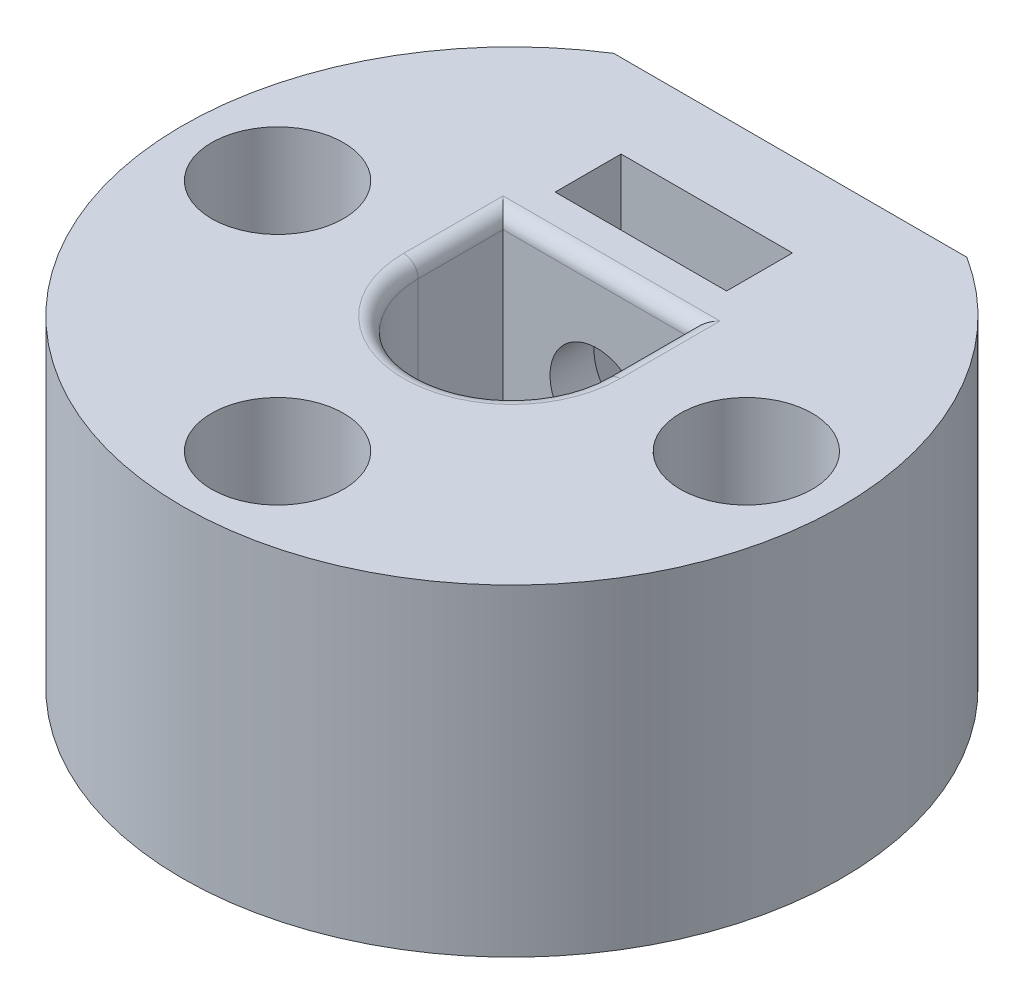
ISO-10303-21;
HEADER;
FILE_DESCRIPTION(('STEP AP214'),'2;1');
FILE_NAME('part.step','',(''),(''),'','','');
FILE_SCHEMA(('AUTOMOTIVE_DESIGN { 1 0 10303 214 1 1 1 1 }'));
ENDSEC;
DATA;
#1=APPLICATION_CONTEXT('core data for automotive mechanical design processes');
#2=APPLICATION_PROTOCOL_DEFINITION('international standard','automotive_design',2000,#1);
#3=PRODUCT_CONTEXT('',#1,'mechanical');
#4=PRODUCT('Part','Part','',(#3));
#5=PRODUCT_RELATED_PRODUCT_CATEGORY('part','',(#4));
#6=PRODUCT_DEFINITION_FORMATION('','',#4);
#7=PRODUCT_DEFINITION_CONTEXT('part definition',#1,'design');
#8=PRODUCT_DEFINITION('design','',#6,#7);
#9=PRODUCT_DEFINITION_SHAPE('','',#8);
#10=(LENGTH_UNIT() NAMED_UNIT(*) SI_UNIT(.MILLI.,.METRE.));
#11=(NAMED_UNIT(*) PLANE_ANGLE_UNIT() SI_UNIT($,.RADIAN.));
#12=(NAMED_UNIT(*) SI_UNIT($,.STERADIAN.) SOLID_ANGLE_UNIT());
#13=UNCERTAINTY_MEASURE_WITH_UNIT(LENGTH_MEASURE(1.E-05),#10,'distance_accuracy_value','');
#14=(GEOMETRIC_REPRESENTATION_CONTEXT(3) GLOBAL_UNCERTAINTY_ASSIGNED_CONTEXT((#13)) GLOBAL_UNIT_ASSIGNED_CONTEXT((#10,
#11,#12)) REPRESENTATION_CONTEXT('',''));
#15=CARTESIAN_POINT('',(0.,0.,0.));
#16=DIRECTION('',(0.,0.,1.));
#17=DIRECTION('',(1.,0.,0.));
#18=AXIS2_PLACEMENT_3D('',#15,#16,#17);
#19=CARTESIAN_POINT('',(0.,8.00000000000001,0.));
#20=DIRECTION('',(0.,1.,0.));
#21=DIRECTION('',(0.,0.,1.));
#22=AXIS2_PLACEMENT_3D('',#19,#20,#21);
#23=PLANE('',#22);
#24=CARTESIAN_POINT('',(-7.99999999999948,7.99999999999965,1.66533453693773E-13));
#25=DIRECTION('',(0.,1.,0.));
#26=DIRECTION('',(0.,0.,1.));
#27=AXIS2_PLACEMENT_3D('',#24,#25,#26);
#28=CIRCLE('',#27,2.25);
#29=CARTESIAN_POINT('',(-7.99999999999949,7.99999999999965,2.25000000000016));
#30=VERTEX_POINT('',#29);
#31=EDGE_CURVE('E484',#30,#30,#28,.T.);
#32=ORIENTED_EDGE('',*,*,#31,.F.);
#33=EDGE_LOOP('',(#32));
#34=FACE_BOUND('',#33,.T.);
#35=CARTESIAN_POINT('',(0.,8.00000000000001,7.99999999999998));
#36=DIRECTION('',(0.,1.,0.));
#37=DIRECTION('',(0.,0.,1.));
#38=AXIS2_PLACEMENT_3D('',#35,#36,#37);
#39=CIRCLE('',#38,2.25);
#40=CARTESIAN_POINT('',(0.,8.00000000000001,10.25));
#41=VERTEX_POINT('',#40);
#42=EDGE_CURVE('E501',#41,#41,#39,.T.);
#43=ORIENTED_EDGE('',*,*,#42,.F.);
#44=EDGE_LOOP('',(#43));
#45=FACE_BOUND('',#44,.T.);
#46=CARTESIAN_POINT('',(8.00000000000008,7.99999999999999,0.));
#47=DIRECTION('',(0.,1.,0.));
#48=DIRECTION('',(0.,0.,1.));
#49=AXIS2_PLACEMENT_3D('',#46,#47,#48);
#50=CIRCLE('',#49,2.25);
#51=CARTESIAN_POINT('',(8.00000000000006,7.99999999999999,2.24999999999994));
#52=VERTEX_POINT('',#51);
#53=EDGE_CURVE('E513',#52,#52,#50,.T.);
#54=ORIENTED_EDGE('',*,*,#53,.F.);
#55=EDGE_LOOP('',(#54));
#56=FACE_BOUND('',#55,.T.);
#57=DIRECTION('',(0.,0.,1.));
#58=VECTOR('',#57,1.);
#59=CARTESIAN_POINT('',(-3.69999999999952,7.99999999999965,0.));
#60=LINE('',#59,#58);
#61=CARTESIAN_POINT('',(-3.69999999999952,7.99999999999965,0.));
#62=VERTEX_POINT('',#61);
#63=CARTESIAN_POINT('',(-3.69999999999956,7.99999999999965,-3.39999999999993));
#64=VERTEX_POINT('',#63);
#65=EDGE_CURVE('E214',#62,#64,#60,.F.);
#66=ORIENTED_EDGE('',*,*,#65,.T.);
#67=DIRECTION('',(-0.999999999999986,0.,0.));
#68=VECTOR('',#67,1.);
#69=CARTESIAN_POINT('',(4.85722573273506E-13,7.99999999999965,-3.39999999999976));
#70=LINE('',#69,#68);
#71=CARTESIAN_POINT('',(3.70000000000005,8.00000000000001,-3.40000000000004));
#72=VERTEX_POINT('',#71);
#73=EDGE_CURVE('E217',#64,#72,#70,.F.);
#74=ORIENTED_EDGE('',*,*,#73,.T.);
#75=DIRECTION('',(0.,0.,-1.));
#76=VECTOR('',#75,1.);
#77=CARTESIAN_POINT('',(3.70000000000005,8.00000000000001,0.));
#78=LINE('',#77,#76);
#79=CARTESIAN_POINT('',(3.70000000000005,8.00000000000001,0.));
#80=VERTEX_POINT('',#79);
#81=EDGE_CURVE('E212',#72,#80,#78,.F.);
#82=ORIENTED_EDGE('',*,*,#81,.T.);
#83=CARTESIAN_POINT('',(0.,8.00000000000001,0.));
#84=DIRECTION('',(0.,1.,0.));
#85=DIRECTION('',(0.,0.,1.));
#86=AXIS2_PLACEMENT_3D('',#83,#84,#85);
#87=CIRCLE('',#86,3.7);
#88=EDGE_CURVE('E210',#80,#62,#87,.F.);
#89=ORIENTED_EDGE('',*,*,#88,.T.);
#90=EDGE_LOOP('',(#66,#74,#82,#89));
#91=FACE_BOUND('',#90,.T.);
#92=CARTESIAN_POINT('',(0.,8.00000000000001,0.));
#93=DIRECTION('',(0.,1.,0.));
#94=DIRECTION('',(0.,0.,1.));
#95=AXIS2_PLACEMENT_3D('',#92,#93,#94);
#96=CIRCLE('',#95,11.25);
#97=CARTESIAN_POINT('',(-6.02598539659659,7.99999999999965,-9.49999999999973));
#98=VERTEX_POINT('',#97);
#99=CARTESIAN_POINT('',(6.02598539659709,7.99999999999999,-9.49999999999993));
#100=VERTEX_POINT('',#99);
#101=EDGE_CURVE('E131',#98,#100,#96,.T.);
#102=ORIENTED_EDGE('',*,*,#101,.T.);
#103=DIRECTION('',(-0.999999999999986,0.,0.));
#104=VECTOR('',#103,1.);
#105=CARTESIAN_POINT('',(6.02598539659709,7.99999999999999,-9.49999999999993));
#106=LINE('',#105,#104);
#107=EDGE_CURVE('E134',#100,#98,#106,.T.);
#108=ORIENTED_EDGE('',*,*,#107,.T.);
#109=EDGE_LOOP('',(#102,#108));
#110=FACE_BOUND('',#109,.T.);
#111=DIRECTION('',(-0.999999999999986,0.,0.));
#112=VECTOR('',#111,1.);
#113=CARTESIAN_POINT('',(-2.92499999999946,7.99999999999965,-6.64999999999982));
#114=LINE('',#113,#112);
#115=CARTESIAN_POINT('',(2.92500000000015,7.99999999999966,-6.64999999999996));
#116=VERTEX_POINT('',#115);
#117=CARTESIAN_POINT('',(-2.92499999999946,7.99999999999965,-6.64999999999982));
#118=VERTEX_POINT('',#117);
#119=EDGE_CURVE('E152',#116,#118,#114,.T.);
#120=ORIENTED_EDGE('',*,*,#119,.F.);
#121=DIRECTION('',(0.,0.,-1.));
#122=VECTOR('',#121,1.);
#123=CARTESIAN_POINT('',(2.92500000000001,8.00000000000001,-4.40000000000001));
#124=LINE('',#123,#122);
#125=CARTESIAN_POINT('',(2.92500000000001,8.00000000000001,-4.40000000000001));
#126=VERTEX_POINT('',#125);
#127=EDGE_CURVE('E150',#126,#116,#124,.T.);
#128=ORIENTED_EDGE('',*,*,#127,.F.);
#129=DIRECTION('',(0.999999999999986,0.,0.));
#130=VECTOR('',#129,1.);
#131=CARTESIAN_POINT('',(-2.92499999999946,7.99999999999965,-4.39999999999976));
#132=LINE('',#131,#130);
#133=CARTESIAN_POINT('',(-2.92499999999946,7.99999999999965,-4.39999999999976));
#134=VERTEX_POINT('',#133);
#135=EDGE_CURVE('E157',#134,#126,#132,.T.);
#136=ORIENTED_EDGE('',*,*,#135,.F.);
#137=DIRECTION('',(0.,0.,1.));
#138=VECTOR('',#137,1.);
#139=CARTESIAN_POINT('',(-2.92499999999946,7.99999999999965,-4.39999999999976));
#140=LINE('',#139,#138);
#141=EDGE_CURVE('E155',#118,#134,#140,.T.);
#142=ORIENTED_EDGE('',*,*,#141,.F.);
#143=EDGE_LOOP('',(#120,#128,#136,#142));
#144=FACE_BOUND('',#143,.T.);
#145=ADVANCED_FACE('F32',(#34,#45,#56,#91,#110,#144),#23,.T.);
#146=CARTESIAN_POINT('',(1.38777878078145E-13,3.99999999999964,-9.50000000000001));
#147=DIRECTION('',(0.,0.,1.));
#148=DIRECTION('',(0.999999999999986,0.,0.));
#149=AXIS2_PLACEMENT_3D('',#146,#147,#148);
#150=CYLINDRICAL_SURFACE('',#149,1.6);
#151=CARTESIAN_POINT('',(1.38777878078145E-13,3.99999999999964,-9.50000000000001));
#152=DIRECTION('',(0.,0.,1.));
#153=DIRECTION('',(0.999999999999986,0.,0.));
#154=AXIS2_PLACEMENT_3D('',#151,#152,#153);
#155=CIRCLE('',#154,1.6);
#156=CARTESIAN_POINT('',(1.60000000000012,3.99999999999965,-9.50000000000002));
#157=VERTEX_POINT('',#156);
#158=EDGE_CURVE('E178',#157,#157,#155,.T.);
#159=ORIENTED_EDGE('',*,*,#158,.F.);
#160=EDGE_LOOP('',(#159));
#161=FACE_BOUND('',#160,.T.);
#162=CARTESIAN_POINT('',(4.9960036108132E-13,3.99999999999964,-6.64999999999991));
#163=DIRECTION('',(0.,0.,1.));
#164=DIRECTION('',(0.999999999999986,0.,0.));
#165=AXIS2_PLACEMENT_3D('',#162,#163,#164);
#166=CIRCLE('',#165,1.6);
#167=CARTESIAN_POINT('',(1.60000000000048,3.99999999999965,-6.64999999999991));
#168=VERTEX_POINT('',#167);
#169=EDGE_CURVE('E36',#168,#168,#166,.F.);
#170=ORIENTED_EDGE('',*,*,#169,.F.);
#171=EDGE_LOOP('',(#170));
#172=FACE_BOUND('',#171,.T.);
#173=ADVANCED_FACE('F239',(#161,#172),#150,.F.);
#174=CARTESIAN_POINT('',(1.66533453693773E-13,3.99999999999964,-2.90000000000007));
#175=DIRECTION('',(0.,0.,1.));
#176=DIRECTION('',(0.999999999999986,0.,0.));
#177=AXIS2_PLACEMENT_3D('',#174,#175,#176);
#178=CIRCLE('',#177,1.6);
#179=CARTESIAN_POINT('',(1.60000000000014,3.99999999999965,-2.90000000000008));
#180=VERTEX_POINT('',#179);
#181=EDGE_CURVE('E181',#180,#180,#178,.T.);
#182=ORIENTED_EDGE('',*,*,#181,.T.);
#183=EDGE_LOOP('',(#182));
#184=FACE_BOUND('',#183,.T.);
#185=CARTESIAN_POINT('',(1.80411241501588E-13,3.99999999999964,-4.39999999999985));
#186=DIRECTION('',(0.,0.,-1.));
#187=DIRECTION('',(-0.999999999999986,0.,0.));
#188=AXIS2_PLACEMENT_3D('',#185,#186,#187);
#189=CIRCLE('',#188,1.6);
#190=CARTESIAN_POINT('',(-1.5999999999998,3.99999999999964,-4.39999999999984));
#191=VERTEX_POINT('',#190);
#192=EDGE_CURVE('E177',#191,#191,#189,.F.);
#193=ORIENTED_EDGE('',*,*,#192,.F.);
#194=EDGE_LOOP('',(#193));
#195=FACE_BOUND('',#194,.T.);
#196=ADVANCED_FACE('F241',(#184,#195),#150,.F.);
#197=CARTESIAN_POINT('',(0.,8.00000000000001,0.));
#198=DIRECTION('',(0.,-1.,0.));
#199=DIRECTION('',(0.,0.,-1.));
#200=AXIS2_PLACEMENT_3D('',#197,#198,#199);
#201=CYLINDRICAL_SURFACE('',#200,11.25);
#202=DIRECTION('',(0.,-1.,0.));
#203=VECTOR('',#202,1.);
#204=CARTESIAN_POINT('',(-6.02598539659659,7.99999999999965,-9.49999999999973));
#205=LINE('',#204,#203);
#206=CARTESIAN_POINT('',(-6.02598539659695,-3.00000000000034,-9.49999999999998));
#207=VERTEX_POINT('',#206);
#208=EDGE_CURVE('E124',#98,#207,#205,.T.);
#209=ORIENTED_EDGE('',*,*,#208,.T.);
#210=CARTESIAN_POINT('',(0.,-3.,0.));
#211=DIRECTION('',(0.,-1.,0.));
#212=DIRECTION('',(0.,0.,-1.));
#213=AXIS2_PLACEMENT_3D('',#210,#211,#212);
#214=CIRCLE('',#213,11.25);
#215=CARTESIAN_POINT('',(6.02598539659709,-3.,-9.49999999999993));
#216=VERTEX_POINT('',#215);
#217=EDGE_CURVE('E129',#216,#207,#214,.T.);
#218=ORIENTED_EDGE('',*,*,#217,.F.);
#219=DIRECTION('',(0.,-1.,0.));
#220=VECTOR('',#219,1.);
#221=CARTESIAN_POINT('',(6.02598539659709,7.99999999999999,-9.49999999999993));
#222=LINE('',#221,#220);
#223=EDGE_CURVE('E133',#100,#216,#222,.T.);
#224=ORIENTED_EDGE('',*,*,#223,.F.);
#225=ORIENTED_EDGE('',*,*,#101,.F.);
#226=EDGE_LOOP('',(#209,#218,#224,#225));
#227=FACE_BOUND('',#226,.T.);
#228=ADVANCED_FACE('F126',(#227),#201,.T.);
#229=CARTESIAN_POINT('',(6.02598539659709,7.99999999999999,-9.49999999999993));
#230=DIRECTION('',(0.,0.,1.));
#231=DIRECTION('',(0.999999999999986,0.,0.));
#232=AXIS2_PLACEMENT_3D('',#229,#230,#231);
#233=PLANE('',#232);
#234=ORIENTED_EDGE('',*,*,#158,.T.);
#235=EDGE_LOOP('',(#234));
#236=FACE_BOUND('',#235,.T.);
#237=ORIENTED_EDGE('',*,*,#223,.T.);
#238=DIRECTION('',(0.999999999999986,0.,0.));
#239=VECTOR('',#238,1.);
#240=CARTESIAN_POINT('',(-6.02598539659695,-3.00000000000034,-9.49999999999998));
#241=LINE('',#240,#239);
#242=EDGE_CURVE('E137',#207,#216,#241,.T.);
#243=ORIENTED_EDGE('',*,*,#242,.F.);
#244=ORIENTED_EDGE('',*,*,#208,.F.);
#245=ORIENTED_EDGE('',*,*,#107,.F.);
#246=EDGE_LOOP('',(#237,#243,#244,#245));
#247=FACE_BOUND('',#246,.T.);
#248=ADVANCED_FACE('F138',(#236,#247),#233,.F.);
#249=CARTESIAN_POINT('',(0.,8.00000000000001,0.));
#250=DIRECTION('',(0.,-1.,0.));
#251=DIRECTION('',(0.,0.,-1.));
#252=AXIS2_PLACEMENT_3D('',#249,#250,#251);
#253=CYLINDRICAL_SURFACE('',#252,3.2);
#254=DIRECTION('',(0.,-1.,0.));
#255=VECTOR('',#254,1.);
#256=CARTESIAN_POINT('',(-3.19999999999979,7.99999999999965,0.));
#257=LINE('',#256,#255);
#258=CARTESIAN_POINT('',(-3.19999999999979,7.49999999999965,0.));
#259=VERTEX_POINT('',#258);
#260=CARTESIAN_POINT('',(-3.19999999999963,-3.60822483003176E-13,2.77555756156289E-13));
#261=VERTEX_POINT('',#260);
#262=EDGE_CURVE('E195',#259,#261,#257,.T.);
#263=ORIENTED_EDGE('',*,*,#262,.F.);
#264=CARTESIAN_POINT('',(0.,7.50000000000001,0.));
#265=DIRECTION('',(0.,1.,0.));
#266=DIRECTION('',(0.,0.,1.));
#267=AXIS2_PLACEMENT_3D('',#264,#265,#266);
#268=CIRCLE('',#267,3.2);
#269=CARTESIAN_POINT('',(3.20000000000027,7.49999999999999,0.));
#270=VERTEX_POINT('',#269);
#271=EDGE_CURVE('E11',#259,#270,#268,.T.);
#272=ORIENTED_EDGE('',*,*,#271,.T.);
#273=DIRECTION('',(0.,-1.,0.));
#274=VECTOR('',#273,1.);
#275=CARTESIAN_POINT('',(3.20000000000027,8.00000000000001,0.));
#276=LINE('',#275,#274);
#277=CARTESIAN_POINT('',(3.20000000000022,0.,0.));
#278=VERTEX_POINT('',#277);
#279=EDGE_CURVE('E202',#270,#278,#276,.T.);
#280=ORIENTED_EDGE('',*,*,#279,.T.);
#281=CARTESIAN_POINT('',(0.,0.,0.));
#282=DIRECTION('',(0.,1.,0.));
#283=DIRECTION('',(0.,0.,1.));
#284=AXIS2_PLACEMENT_3D('',#281,#282,#283);
#285=CIRCLE('',#284,3.2);
#286=EDGE_CURVE('E182',#261,#278,#285,.T.);
#287=ORIENTED_EDGE('',*,*,#286,.F.);
#288=EDGE_LOOP('',(#263,#272,#280,#287));
#289=FACE_BOUND('',#288,.T.);
#290=ADVANCED_FACE('F267',(#289),#253,.F.);
#291=CARTESIAN_POINT('',(3.20000000000027,8.00000000000001,0.));
#292=DIRECTION('',(-0.999999999999986,0.,0.));
#293=DIRECTION('',(0.,0.,1.));
#294=AXIS2_PLACEMENT_3D('',#291,#292,#293);
#295=PLANE('',#294);
#296=ORIENTED_EDGE('',*,*,#279,.F.);
#297=DIRECTION('',(0.,0.,-1.));
#298=VECTOR('',#297,1.);
#299=CARTESIAN_POINT('',(3.20000000000027,7.49999999999999,0.));
#300=LINE('',#299,#298);
#301=CARTESIAN_POINT('',(3.20000000000004,7.49999999999999,-2.89999999999996));
#302=VERTEX_POINT('',#301);
#303=EDGE_CURVE('E57',#270,#302,#300,.T.);
#304=ORIENTED_EDGE('',*,*,#303,.T.);
#305=DIRECTION('',(0.,-1.,0.));
#306=VECTOR('',#305,1.);
#307=CARTESIAN_POINT('',(3.20000000000004,8.00000000000001,-2.89999999999996));
#308=LINE('',#307,#306);
#309=CARTESIAN_POINT('',(3.20000000000004,0.,-2.89999999999996));
#310=VERTEX_POINT('',#309);
#311=EDGE_CURVE('E200',#302,#310,#308,.T.);
#312=ORIENTED_EDGE('',*,*,#311,.T.);
#313=DIRECTION('',(0.,0.,-1.));
#314=VECTOR('',#313,1.);
#315=CARTESIAN_POINT('',(3.20000000000022,0.,0.));
#316=LINE('',#315,#314);
#317=EDGE_CURVE('E185',#278,#310,#316,.T.);
#318=ORIENTED_EDGE('',*,*,#317,.F.);
#319=EDGE_LOOP('',(#296,#304,#312,#318));
#320=FACE_BOUND('',#319,.T.);
#321=ADVANCED_FACE('F263',(#320),#295,.T.);
#322=CARTESIAN_POINT('',(3.20000000000004,8.00000000000001,-2.89999999999996));
#323=DIRECTION('',(0.,0.,1.));
#324=DIRECTION('',(0.999999999999986,0.,0.));
#325=AXIS2_PLACEMENT_3D('',#322,#323,#324);
#326=PLANE('',#325);
#327=ORIENTED_EDGE('',*,*,#181,.F.);
#328=EDGE_LOOP('',(#327));
#329=FACE_BOUND('',#328,.T.);
#330=ORIENTED_EDGE('',*,*,#311,.F.);
#331=DIRECTION('',(-0.999999999999986,0.,0.));
#332=VECTOR('',#331,1.);
#333=CARTESIAN_POINT('',(3.20000000000004,7.49999999999999,-2.89999999999996));
#334=LINE('',#333,#332);
#335=CARTESIAN_POINT('',(-3.19999999999947,7.49999999999965,-2.89999999999996));
#336=VERTEX_POINT('',#335);
#337=EDGE_CURVE('E41',#302,#336,#334,.T.);
#338=ORIENTED_EDGE('',*,*,#337,.T.);
#339=DIRECTION('',(0.,-1.,0.));
#340=VECTOR('',#339,1.);
#341=CARTESIAN_POINT('',(-3.19999999999947,7.99999999999965,-2.89999999999996));
#342=LINE('',#341,#340);
#343=CARTESIAN_POINT('',(-3.19999999999995,-3.60822483003176E-13,-2.89999999999996));
#344=VERTEX_POINT('',#343);
#345=EDGE_CURVE('E198',#336,#344,#342,.T.);
#346=ORIENTED_EDGE('',*,*,#345,.T.);
#347=DIRECTION('',(-0.999999999999984,0.,0.));
#348=VECTOR('',#347,1.);
#349=CARTESIAN_POINT('',(3.20000000000004,0.,-2.89999999999996));
#350=LINE('',#349,#348);
#351=EDGE_CURVE('E189',#310,#344,#350,.T.);
#352=ORIENTED_EDGE('',*,*,#351,.F.);
#353=EDGE_LOOP('',(#330,#338,#346,#352));
#354=FACE_BOUND('',#353,.T.);
#355=ADVANCED_FACE('F259',(#329,#354),#326,.T.);
#356=CARTESIAN_POINT('',(-3.19999999999979,7.99999999999965,0.));
#357=DIRECTION('',(0.999999999999986,0.,0.));
#358=DIRECTION('',(0.,0.,-1.));
#359=AXIS2_PLACEMENT_3D('',#356,#357,#358);
#360=PLANE('',#359);
#361=ORIENTED_EDGE('',*,*,#345,.F.);
#362=DIRECTION('',(0.,0.,1.));
#363=VECTOR('',#362,1.);
#364=CARTESIAN_POINT('',(-3.19999999999979,7.49999999999965,0.));
#365=LINE('',#364,#363);
#366=EDGE_CURVE('E207',#336,#259,#365,.T.);
#367=ORIENTED_EDGE('',*,*,#366,.T.);
#368=ORIENTED_EDGE('',*,*,#262,.T.);
#369=DIRECTION('',(0.,0.,1.));
#370=VECTOR('',#369,1.);
#371=CARTESIAN_POINT('',(-3.19999999999963,-3.60822483003176E-13,2.77555756156289E-13));
#372=LINE('',#371,#370);
#373=EDGE_CURVE('E192',#344,#261,#372,.T.);
#374=ORIENTED_EDGE('',*,*,#373,.F.);
#375=EDGE_LOOP('',(#361,#367,#368,#374));
#376=FACE_BOUND('',#375,.T.);
#377=ADVANCED_FACE('F256',(#376),#360,.T.);
#378=CARTESIAN_POINT('',(3.70000000000005,7.49999999999999,0.));
#379=DIRECTION('',(0.,0.,-1.));
#380=DIRECTION('',(-0.999999999999986,0.,0.));
#381=AXIS2_PLACEMENT_3D('',#378,#379,#380);
#382=CYLINDRICAL_SURFACE('',#381,0.5);
#383=CARTESIAN_POINT('',(3.70000000000005,7.49999999999999,0.));
#384=DIRECTION('',(0.,0.,1.));
#385=DIRECTION('',(0.999999999999986,0.,0.));
#386=AXIS2_PLACEMENT_3D('',#383,#384,#385);
#387=CIRCLE('',#386,0.5);
#388=EDGE_CURVE('E225',#80,#270,#387,.T.);
#389=ORIENTED_EDGE('',*,*,#388,.F.);
#390=ORIENTED_EDGE('',*,*,#81,.F.);
#391=CARTESIAN_POINT('',(3.70000000000005,7.49999999999999,-3.40000000000004));
#392=DIRECTION('',(-0.707106781186533,0.,-0.707106781186545));
#393=DIRECTION('',(0.70710678118654,0.,-0.707106781186552));
#394=AXIS2_PLACEMENT_3D('',#391,#392,#393);
#395=ELLIPSE('',#394,0.707106781186547,0.5);
#396=EDGE_CURVE('E186',#302,#72,#395,.T.);
#397=ORIENTED_EDGE('',*,*,#396,.F.);
#398=ORIENTED_EDGE('',*,*,#303,.F.);
#399=EDGE_LOOP('',(#389,#390,#397,#398));
#400=FACE_BOUND('',#399,.T.);
#401=ADVANCED_FACE('F34',(#400),#382,.T.);
#402=CARTESIAN_POINT('',(3.20000000000033,7.49999999999999,-3.39999999999988));
#403=DIRECTION('',(-0.999999999999986,0.,0.));
#404=DIRECTION('',(0.,0.,1.));
#405=AXIS2_PLACEMENT_3D('',#402,#403,#404);
#406=CYLINDRICAL_SURFACE('',#405,0.5);
#407=ORIENTED_EDGE('',*,*,#396,.T.);
#408=ORIENTED_EDGE('',*,*,#73,.F.);
#409=CARTESIAN_POINT('',(-3.69999999999956,7.49999999999965,-3.39999999999993));
#410=DIRECTION('',(-0.70710678118654,0.,0.707106781186552));
#411=DIRECTION('',(0.707106781186533,0.,0.707106781186545));
#412=AXIS2_PLACEMENT_3D('',#409,#410,#411);
#413=ELLIPSE('',#412,0.707106781186547,0.5);
#414=EDGE_CURVE('E223',#336,#64,#413,.T.);
#415=ORIENTED_EDGE('',*,*,#414,.F.);
#416=ORIENTED_EDGE('',*,*,#337,.F.);
#417=EDGE_LOOP('',(#407,#408,#415,#416));
#418=FACE_BOUND('',#417,.T.);
#419=ADVANCED_FACE('F282',(#418),#406,.T.);
#420=CARTESIAN_POINT('',(0.,7.50000000000001,0.));
#421=DIRECTION('',(0.,1.,0.));
#422=DIRECTION('',(0.,0.,1.));
#423=AXIS2_PLACEMENT_3D('',#420,#421,#422);
#424=TOROIDAL_SURFACE('',#423,3.7,0.5);
#425=ORIENTED_EDGE('',*,*,#388,.T.);
#426=ORIENTED_EDGE('',*,*,#271,.F.);
#427=CARTESIAN_POINT('',(-3.69999999999952,7.49999999999965,0.));
#428=DIRECTION('',(0.,0.,-1.));
#429=DIRECTION('',(-0.999999999999986,0.,0.));
#430=AXIS2_PLACEMENT_3D('',#427,#428,#429);
#431=CIRCLE('',#430,0.5);
#432=EDGE_CURVE('E221',#62,#259,#431,.T.);
#433=ORIENTED_EDGE('',*,*,#432,.F.);
#434=ORIENTED_EDGE('',*,*,#88,.F.);
#435=EDGE_LOOP('',(#425,#426,#433,#434));
#436=FACE_BOUND('',#435,.T.);
#437=ADVANCED_FACE('F279',(#436),#424,.T.);
#438=CARTESIAN_POINT('',(-3.69999999999952,7.49999999999965,0.));
#439=DIRECTION('',(0.,0.,1.));
#440=DIRECTION('',(0.999999999999986,0.,0.));
#441=AXIS2_PLACEMENT_3D('',#438,#439,#440);
#442=CYLINDRICAL_SURFACE('',#441,0.5);
#443=ORIENTED_EDGE('',*,*,#414,.T.);
#444=ORIENTED_EDGE('',*,*,#65,.F.);
#445=ORIENTED_EDGE('',*,*,#432,.T.);
#446=ORIENTED_EDGE('',*,*,#366,.F.);
#447=EDGE_LOOP('',(#443,#444,#445,#446));
#448=FACE_BOUND('',#447,.T.);
#449=ADVANCED_FACE('F276',(#448),#442,.T.);
#450=CARTESIAN_POINT('',(-2.92499999999946,7.99999999999965,-6.64999999999982));
#451=DIRECTION('',(0.,0.,1.));
#452=DIRECTION('',(0.999999999999986,0.,0.));
#453=AXIS2_PLACEMENT_3D('',#450,#451,#452);
#454=PLANE('',#453);
#455=DIRECTION('',(-0.999999999999986,0.,0.));
#456=VECTOR('',#455,1.);
#457=CARTESIAN_POINT('',(-2.92500000000001,-3.33066907387547E-13,-6.64999999999996));
#458=LINE('',#457,#456);
#459=CARTESIAN_POINT('',(2.92500000000005,-3.60822483003176E-13,-6.64999999999999));
#460=VERTEX_POINT('',#459);
#461=CARTESIAN_POINT('',(-2.92500000000001,-3.33066907387547E-13,-6.64999999999996));
#462=VERTEX_POINT('',#461);
#463=EDGE_CURVE('E162',#460,#462,#458,.T.);
#464=ORIENTED_EDGE('',*,*,#463,.F.);
#465=DIRECTION('',(0.,-1.,0.));
#466=VECTOR('',#465,1.);
#467=CARTESIAN_POINT('',(2.92500000000015,7.99999999999966,-6.64999999999996));
#468=LINE('',#467,#466);
#469=EDGE_CURVE('E174',#116,#460,#468,.T.);
#470=ORIENTED_EDGE('',*,*,#469,.F.);
#471=ORIENTED_EDGE('',*,*,#119,.T.);
#472=DIRECTION('',(0.,-1.,0.));
#473=VECTOR('',#472,1.);
#474=CARTESIAN_POINT('',(-2.92499999999946,7.99999999999965,-6.64999999999982));
#475=LINE('',#474,#473);
#476=EDGE_CURVE('E172',#118,#462,#475,.T.);
#477=ORIENTED_EDGE('',*,*,#476,.T.);
#478=EDGE_LOOP('',(#464,#470,#471,#477));
#479=FACE_BOUND('',#478,.T.);
#480=ORIENTED_EDGE('',*,*,#169,.T.);
#481=EDGE_LOOP('',(#480));
#482=FACE_BOUND('',#481,.T.);
#483=ADVANCED_FACE('F237',(#479,#482),#454,.T.);
#484=CARTESIAN_POINT('',(-2.92499999999946,7.99999999999965,-4.39999999999976));
#485=DIRECTION('',(0.,0.,-1.));
#486=DIRECTION('',(-0.999999999999986,0.,0.));
#487=AXIS2_PLACEMENT_3D('',#484,#485,#486);
#488=PLANE('',#487);
#489=DIRECTION('',(0.999999999999986,0.,0.));
#490=VECTOR('',#489,1.);
#491=CARTESIAN_POINT('',(-2.92499999999955,-3.60822483003176E-13,-4.39999999999982));
#492=LINE('',#491,#490);
#493=CARTESIAN_POINT('',(-2.92499999999955,-3.60822483003176E-13,-4.39999999999982));
#494=VERTEX_POINT('',#493);
#495=CARTESIAN_POINT('',(2.92500000000001,0.,-4.40000000000001));
#496=VERTEX_POINT('',#495);
#497=EDGE_CURVE('E153',#494,#496,#492,.T.);
#498=ORIENTED_EDGE('',*,*,#497,.F.);
#499=DIRECTION('',(0.,-1.,0.));
#500=VECTOR('',#499,1.);
#501=CARTESIAN_POINT('',(-2.92499999999946,7.99999999999965,-4.39999999999976));
#502=LINE('',#501,#500);
#503=EDGE_CURVE('E49',#134,#494,#502,.T.);
#504=ORIENTED_EDGE('',*,*,#503,.F.);
#505=ORIENTED_EDGE('',*,*,#135,.T.);
#506=DIRECTION('',(0.,-1.,0.));
#507=VECTOR('',#506,1.);
#508=CARTESIAN_POINT('',(2.92500000000001,8.00000000000001,-4.40000000000001));
#509=LINE('',#508,#507);
#510=EDGE_CURVE('E159',#126,#496,#509,.T.);
#511=ORIENTED_EDGE('',*,*,#510,.T.);
#512=EDGE_LOOP('',(#498,#504,#505,#511));
#513=FACE_BOUND('',#512,.T.);
#514=ORIENTED_EDGE('',*,*,#192,.T.);
#515=EDGE_LOOP('',(#514));
#516=FACE_BOUND('',#515,.T.);
#517=ADVANCED_FACE('F325',(#513,#516),#488,.T.);
#518=CARTESIAN_POINT('',(2.92500000000001,8.00000000000001,-4.40000000000001));
#519=DIRECTION('',(-0.999999999999986,0.,0.));
#520=DIRECTION('',(0.,0.,1.));
#521=AXIS2_PLACEMENT_3D('',#518,#519,#520);
#522=PLANE('',#521);
#523=DIRECTION('',(0.,0.,-1.));
#524=VECTOR('',#523,1.);
#525=CARTESIAN_POINT('',(2.92500000000001,0.,-4.40000000000001));
#526=LINE('',#525,#524);
#527=EDGE_CURVE('E140',#496,#460,#526,.T.);
#528=ORIENTED_EDGE('',*,*,#527,.F.);
#529=ORIENTED_EDGE('',*,*,#510,.F.);
#530=ORIENTED_EDGE('',*,*,#127,.T.);
#531=ORIENTED_EDGE('',*,*,#469,.T.);
#532=EDGE_LOOP('',(#528,#529,#530,#531));
#533=FACE_BOUND('',#532,.T.);
#534=ADVANCED_FACE('F254',(#533),#522,.T.);
#535=CARTESIAN_POINT('',(-2.92499999999946,7.99999999999965,-4.39999999999976));
#536=DIRECTION('',(0.999999999999986,0.,0.));
#537=DIRECTION('',(0.,0.,-1.));
#538=AXIS2_PLACEMENT_3D('',#535,#536,#537);
#539=PLANE('',#538);
#540=DIRECTION('',(0.,0.,1.));
#541=VECTOR('',#540,1.);
#542=CARTESIAN_POINT('',(-2.92499999999955,-3.60822483003176E-13,-4.39999999999982));
#543=LINE('',#542,#541);
#544=EDGE_CURVE('E165',#462,#494,#543,.T.);
#545=ORIENTED_EDGE('',*,*,#544,.F.);
#546=ORIENTED_EDGE('',*,*,#476,.F.);
#547=ORIENTED_EDGE('',*,*,#141,.T.);
#548=ORIENTED_EDGE('',*,*,#503,.T.);
#549=EDGE_LOOP('',(#545,#546,#547,#548));
#550=FACE_BOUND('',#549,.T.);
#551=ADVANCED_FACE('F321',(#550),#539,.T.);
#552=CARTESIAN_POINT('',(0.,0.,0.));
#553=DIRECTION('',(0.,-1.,0.));
#554=DIRECTION('',(0.,0.,-1.));
#555=AXIS2_PLACEMENT_3D('',#552,#553,#554);
#556=PLANE('',#555);
#557=ORIENTED_EDGE('',*,*,#497,.T.);
#558=ORIENTED_EDGE('',*,*,#527,.T.);
#559=ORIENTED_EDGE('',*,*,#463,.T.);
#560=ORIENTED_EDGE('',*,*,#544,.T.);
#561=EDGE_LOOP('',(#557,#558,#559,#560));
#562=FACE_BOUND('',#561,.T.);
#563=ADVANCED_FACE('F312',(#562),#556,.F.);
#564=ORIENTED_EDGE('',*,*,#373,.T.);
#565=ORIENTED_EDGE('',*,*,#286,.T.);
#566=ORIENTED_EDGE('',*,*,#317,.T.);
#567=ORIENTED_EDGE('',*,*,#351,.T.);
#568=EDGE_LOOP('',(#564,#565,#566,#567));
#569=FACE_BOUND('',#568,.T.);
#570=ADVANCED_FACE('F308',(#569),#556,.F.);
#571=CARTESIAN_POINT('',(0.,-3.,0.));
#572=DIRECTION('',(0.,-1.,0.));
#573=DIRECTION('',(0.,0.,-1.));
#574=AXIS2_PLACEMENT_3D('',#571,#572,#573);
#575=PLANE('',#574);
#576=CARTESIAN_POINT('',(0.,-3.,0.));
#577=DIRECTION('',(0.,-1.,0.));
#578=DIRECTION('',(0.,0.,-1.));
#579=AXIS2_PLACEMENT_3D('',#576,#577,#578);
#580=CIRCLE('',#579,4.25);
#581=CARTESIAN_POINT('',(0.,-3.00000000000001,-4.25));
#582=VERTEX_POINT('',#581);
#583=EDGE_CURVE('E485',#582,#582,#580,.T.);
#584=ORIENTED_EDGE('',*,*,#583,.F.);
#585=EDGE_LOOP('',(#584));
#586=FACE_BOUND('',#585,.T.);
#587=CARTESIAN_POINT('',(-7.99999999999992,-3.00000000000036,0.));
#588=DIRECTION('',(0.,1.,0.));
#589=DIRECTION('',(0.,0.,1.));
#590=AXIS2_PLACEMENT_3D('',#587,#588,#589);
#591=CIRCLE('',#590,1.25);
#592=CARTESIAN_POINT('',(-7.99999999999993,-3.00000000000036,1.25000000000003));
#593=VERTEX_POINT('',#592);
#594=EDGE_CURVE('E498',#593,#593,#591,.T.);
#595=ORIENTED_EDGE('',*,*,#594,.T.);
#596=EDGE_LOOP('',(#595));
#597=FACE_BOUND('',#596,.T.);
#598=CARTESIAN_POINT('',(0.,-3.,8.00000000000004));
#599=DIRECTION('',(0.,1.,0.));
#600=DIRECTION('',(0.,0.,1.));
#601=AXIS2_PLACEMENT_3D('',#598,#599,#600);
#602=CIRCLE('',#601,1.25);
#603=CARTESIAN_POINT('',(0.,-3.,9.25000000000004));
#604=VERTEX_POINT('',#603);
#605=EDGE_CURVE('E510',#604,#604,#602,.T.);
#606=ORIENTED_EDGE('',*,*,#605,.T.);
#607=EDGE_LOOP('',(#606));
#608=FACE_BOUND('',#607,.T.);
#609=CARTESIAN_POINT('',(8.00000000000019,-3.,0.));
#610=DIRECTION('',(0.,1.,0.));
#611=DIRECTION('',(0.,0.,1.));
#612=AXIS2_PLACEMENT_3D('',#609,#610,#611);
#613=CIRCLE('',#612,1.25);
#614=CARTESIAN_POINT('',(8.00000000000018,-3.,1.25000000000006));
#615=VERTEX_POINT('',#614);
#616=EDGE_CURVE('E143',#615,#615,#613,.T.);
#617=ORIENTED_EDGE('',*,*,#616,.T.);
#618=EDGE_LOOP('',(#617));
#619=FACE_BOUND('',#618,.T.);
#620=ORIENTED_EDGE('',*,*,#217,.T.);
#621=ORIENTED_EDGE('',*,*,#242,.T.);
#622=EDGE_LOOP('',(#620,#621));
#623=FACE_BOUND('',#622,.T.);
#624=ADVANCED_FACE('F142',(#586,#597,#608,#619,#623),#575,.T.);
#625=CARTESIAN_POINT('',(8.00000000000008,7.99999999999999,0.));
#626=DIRECTION('',(0.,1.,0.));
#627=DIRECTION('',(0.,0.,1.));
#628=AXIS2_PLACEMENT_3D('',#625,#626,#627);
#629=CYLINDRICAL_SURFACE('',#628,1.25);
#630=ORIENTED_EDGE('',*,*,#616,.F.);
#631=EDGE_LOOP('',(#630));
#632=FACE_BOUND('',#631,.T.);
#633=CARTESIAN_POINT('',(8.00000000000008,2.69999999999999,0.));
#634=DIRECTION('',(0.,1.,0.));
#635=DIRECTION('',(0.,0.,1.));
#636=AXIS2_PLACEMENT_3D('',#633,#634,#635);
#637=CIRCLE('',#636,1.25);
#638=CARTESIAN_POINT('',(8.00000000000007,2.69999999999999,1.24999999999994));
#639=VERTEX_POINT('',#638);
#640=EDGE_CURVE('E146',#639,#639,#637,.T.);
#641=ORIENTED_EDGE('',*,*,#640,.T.);
#642=EDGE_LOOP('',(#641));
#643=FACE_BOUND('',#642,.T.);
#644=ADVANCED_FACE('F318',(#632,#643),#629,.F.);
#645=CARTESIAN_POINT('',(9.25000000000004,2.69999999999999,0.));
#646=DIRECTION('',(0.,-1.,0.));
#647=DIRECTION('',(0.,0.,-1.));
#648=AXIS2_PLACEMENT_3D('',#645,#646,#647);
#649=PLANE('',#648);
#650=ORIENTED_EDGE('',*,*,#640,.F.);
#651=EDGE_LOOP('',(#650));
#652=FACE_BOUND('',#651,.T.);
#653=CARTESIAN_POINT('',(8.00000000000008,2.69999999999999,0.));
#654=DIRECTION('',(0.,1.,0.));
#655=DIRECTION('',(0.,0.,1.));
#656=AXIS2_PLACEMENT_3D('',#653,#654,#655);
#657=CIRCLE('',#656,2.25);
#658=CARTESIAN_POINT('',(8.00000000000006,2.7,2.24999999999995));
#659=VERTEX_POINT('',#658);
#660=EDGE_CURVE('E516',#659,#659,#657,.T.);
#661=ORIENTED_EDGE('',*,*,#660,.T.);
#662=EDGE_LOOP('',(#661));
#663=FACE_BOUND('',#662,.T.);
#664=ADVANCED_FACE('F378',(#652,#663),#649,.F.);
#665=CARTESIAN_POINT('',(8.00000000000008,7.99999999999999,0.));
#666=DIRECTION('',(0.,1.,0.));
#667=DIRECTION('',(0.,0.,1.));
#668=AXIS2_PLACEMENT_3D('',#665,#666,#667);
#669=CYLINDRICAL_SURFACE('',#668,2.25);
#670=ORIENTED_EDGE('',*,*,#660,.F.);
#671=EDGE_LOOP('',(#670));
#672=FACE_BOUND('',#671,.T.);
#673=ORIENTED_EDGE('',*,*,#53,.T.);
#674=EDGE_LOOP('',(#673));
#675=FACE_BOUND('',#674,.T.);
#676=ADVANCED_FACE('F387',(#672,#675),#669,.F.);
#677=CARTESIAN_POINT('',(0.,8.00000000000001,7.99999999999998));
#678=DIRECTION('',(0.,1.,0.));
#679=DIRECTION('',(0.,0.,1.));
#680=AXIS2_PLACEMENT_3D('',#677,#678,#679);
#681=CYLINDRICAL_SURFACE('',#680,1.25);
#682=ORIENTED_EDGE('',*,*,#605,.F.);
#683=EDGE_LOOP('',(#682));
#684=FACE_BOUND('',#683,.T.);
#685=CARTESIAN_POINT('',(0.,2.70000000000002,8.00000000000004));
#686=DIRECTION('',(0.,1.,0.));
#687=DIRECTION('',(0.,0.,1.));
#688=AXIS2_PLACEMENT_3D('',#685,#686,#687);
#689=CIRCLE('',#688,1.25);
#690=CARTESIAN_POINT('',(0.,2.70000000000002,9.25000000000004));
#691=VERTEX_POINT('',#690);
#692=EDGE_CURVE('E507',#691,#691,#689,.T.);
#693=ORIENTED_EDGE('',*,*,#692,.T.);
#694=EDGE_LOOP('',(#693));
#695=FACE_BOUND('',#694,.T.);
#696=ADVANCED_FACE('F397',(#684,#695),#681,.F.);
#697=CARTESIAN_POINT('',(1.25000000000004,2.70000000000002,8.00000000000004));
#698=DIRECTION('',(0.,-1.,0.));
#699=DIRECTION('',(0.,0.,-1.));
#700=AXIS2_PLACEMENT_3D('',#697,#698,#699);
#701=PLANE('',#700);
#702=ORIENTED_EDGE('',*,*,#692,.F.);
#703=EDGE_LOOP('',(#702));
#704=FACE_BOUND('',#703,.T.);
#705=CARTESIAN_POINT('',(0.,2.70000000000002,8.00000000000004));
#706=DIRECTION('',(0.,1.,0.));
#707=DIRECTION('',(0.,0.,1.));
#708=AXIS2_PLACEMENT_3D('',#705,#706,#707);
#709=CIRCLE('',#708,2.25);
#710=CARTESIAN_POINT('',(0.,2.70000000000002,10.25));
#711=VERTEX_POINT('',#710);
#712=EDGE_CURVE('E504',#711,#711,#709,.T.);
#713=ORIENTED_EDGE('',*,*,#712,.T.);
#714=EDGE_LOOP('',(#713));
#715=FACE_BOUND('',#714,.T.);
#716=ADVANCED_FACE('F407',(#704,#715),#701,.F.);
#717=CARTESIAN_POINT('',(0.,8.00000000000001,7.99999999999998));
#718=DIRECTION('',(0.,1.,0.));
#719=DIRECTION('',(0.,0.,1.));
#720=AXIS2_PLACEMENT_3D('',#717,#718,#719);
#721=CYLINDRICAL_SURFACE('',#720,2.25);
#722=ORIENTED_EDGE('',*,*,#712,.F.);
#723=EDGE_LOOP('',(#722));
#724=FACE_BOUND('',#723,.T.);
#725=ORIENTED_EDGE('',*,*,#42,.T.);
#726=EDGE_LOOP('',(#725));
#727=FACE_BOUND('',#726,.T.);
#728=ADVANCED_FACE('F417',(#724,#727),#721,.F.);
#729=CARTESIAN_POINT('',(-7.99999999999948,7.99999999999965,1.66533453693773E-13));
#730=DIRECTION('',(0.,1.,0.));
#731=DIRECTION('',(0.,0.,1.));
#732=AXIS2_PLACEMENT_3D('',#729,#730,#731);
#733=CYLINDRICAL_SURFACE('',#732,1.25);
#734=ORIENTED_EDGE('',*,*,#594,.F.);
#735=EDGE_LOOP('',(#734));
#736=FACE_BOUND('',#735,.T.);
#737=CARTESIAN_POINT('',(-7.99999999999955,2.69999999999965,1.38777878078145E-13));
#738=DIRECTION('',(0.,1.,0.));
#739=DIRECTION('',(0.,0.,1.));
#740=AXIS2_PLACEMENT_3D('',#737,#738,#739);
#741=CIRCLE('',#740,1.25);
#742=CARTESIAN_POINT('',(-7.99999999999956,2.69999999999965,1.25000000000014));
#743=VERTEX_POINT('',#742);
#744=EDGE_CURVE('E495',#743,#743,#741,.T.);
#745=ORIENTED_EDGE('',*,*,#744,.T.);
#746=EDGE_LOOP('',(#745));
#747=FACE_BOUND('',#746,.T.);
#748=ADVANCED_FACE('F427',(#736,#747),#733,.F.);
#749=CARTESIAN_POINT('',(-6.74999999999962,2.69999999999965,0.));
#750=DIRECTION('',(0.,-1.,0.));
#751=DIRECTION('',(0.,0.,-1.));
#752=AXIS2_PLACEMENT_3D('',#749,#750,#751);
#753=PLANE('',#752);
#754=ORIENTED_EDGE('',*,*,#744,.F.);
#755=EDGE_LOOP('',(#754));
#756=FACE_BOUND('',#755,.T.);
#757=CARTESIAN_POINT('',(-7.99999999999955,2.69999999999965,1.38777878078145E-13));
#758=DIRECTION('',(0.,1.,0.));
#759=DIRECTION('',(0.,0.,1.));
#760=AXIS2_PLACEMENT_3D('',#757,#758,#759);
#761=CIRCLE('',#760,2.25);
#762=CARTESIAN_POINT('',(-7.99999999999956,2.69999999999965,2.25000000000014));
#763=VERTEX_POINT('',#762);
#764=EDGE_CURVE('E488',#763,#763,#761,.T.);
#765=ORIENTED_EDGE('',*,*,#764,.T.);
#766=EDGE_LOOP('',(#765));
#767=FACE_BOUND('',#766,.T.);
#768=ADVANCED_FACE('F437',(#756,#767),#753,.F.);
#769=CARTESIAN_POINT('',(-7.99999999999948,7.99999999999965,1.66533453693773E-13));
#770=DIRECTION('',(0.,1.,0.));
#771=DIRECTION('',(0.,0.,1.));
#772=AXIS2_PLACEMENT_3D('',#769,#770,#771);
#773=CYLINDRICAL_SURFACE('',#772,2.25);
#774=ORIENTED_EDGE('',*,*,#764,.F.);
#775=EDGE_LOOP('',(#774));
#776=FACE_BOUND('',#775,.T.);
#777=ORIENTED_EDGE('',*,*,#31,.T.);
#778=EDGE_LOOP('',(#777));
#779=FACE_BOUND('',#778,.T.);
#780=ADVANCED_FACE('F447',(#776,#779),#773,.F.);
#781=CARTESIAN_POINT('',(0.,-1.,0.));
#782=DIRECTION('',(0.,-1.,0.));
#783=DIRECTION('',(0.,0.,-1.));
#784=AXIS2_PLACEMENT_3D('',#781,#782,#783);
#785=CYLINDRICAL_SURFACE('',#784,4.25);
#786=CARTESIAN_POINT('',(0.,-1.,0.));
#787=DIRECTION('',(0.,-1.,0.));
#788=DIRECTION('',(0.,0.,-1.));
#789=AXIS2_PLACEMENT_3D('',#786,#787,#788);
#790=CIRCLE('',#789,4.25);
#791=CARTESIAN_POINT('',(0.,-1.,-4.25));
#792=VERTEX_POINT('',#791);
#793=EDGE_CURVE('E483',#792,#792,#790,.T.);
#794=ORIENTED_EDGE('',*,*,#793,.F.);
#795=EDGE_LOOP('',(#794));
#796=FACE_BOUND('',#795,.T.);
#797=ORIENTED_EDGE('',*,*,#583,.T.);
#798=EDGE_LOOP('',(#797));
#799=FACE_BOUND('',#798,.T.);
#800=ADVANCED_FACE('F457',(#796,#799),#785,.F.);
#801=CARTESIAN_POINT('',(0.,-1.,0.));
#802=DIRECTION('',(0.,-1.,0.));
#803=DIRECTION('',(0.,0.,-1.));
#804=AXIS2_PLACEMENT_3D('',#801,#802,#803);
#805=PLANE('',#804);
#806=ORIENTED_EDGE('',*,*,#793,.T.);
#807=EDGE_LOOP('',(#806));
#808=FACE_BOUND('',#807,.T.);
#809=ADVANCED_FACE('F467',(#808),#805,.T.);
#810=CLOSED_SHELL('',(#145,#173,#196,#228,#248,#290,#321,#355,#377,#401,#419,#437,#449,#483,
#517,#534,#551,#563,#570,#624,#644,#664,#676,#696,#716,#728,#748,#768,#780,#800,#809));
#811=MANIFOLD_SOLID_BREP('B2',#810);
#812=ADVANCED_BREP_SHAPE_REPRESENTATION('',(#18,#811),#14);
#813=SHAPE_DEFINITION_REPRESENTATION(#9,#812);
ENDSEC;
END-ISO-10303-21;
